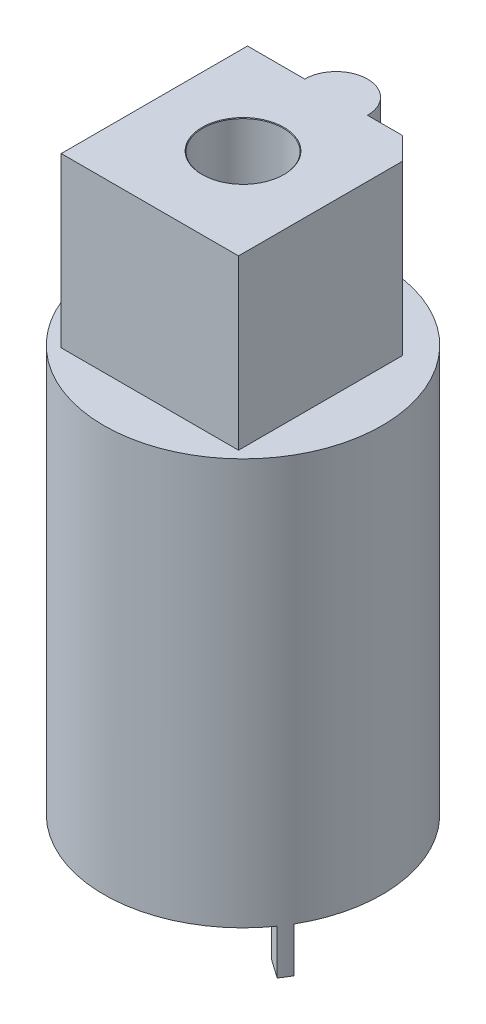
ISO-10303-21;
HEADER;
FILE_DESCRIPTION(('STEP AP214'),'2;1');
FILE_NAME('part.step','',(''),(''),'','','');
FILE_SCHEMA(('AUTOMOTIVE_DESIGN { 1 0 10303 214 1 1 1 1 }'));
ENDSEC;
DATA;
#1=APPLICATION_CONTEXT('core data for automotive mechanical design processes');
#2=APPLICATION_PROTOCOL_DEFINITION('international standard','automotive_design',2000,#1);
#3=PRODUCT_CONTEXT('',#1,'mechanical');
#4=PRODUCT('Part','Part','',(#3));
#5=PRODUCT_RELATED_PRODUCT_CATEGORY('part','',(#4));
#6=PRODUCT_DEFINITION_FORMATION('','',#4);
#7=PRODUCT_DEFINITION_CONTEXT('part definition',#1,'design');
#8=PRODUCT_DEFINITION('design','',#6,#7);
#9=PRODUCT_DEFINITION_SHAPE('','',#8);
#10=(LENGTH_UNIT() NAMED_UNIT(*) SI_UNIT(.MILLI.,.METRE.));
#11=(NAMED_UNIT(*) PLANE_ANGLE_UNIT() SI_UNIT($,.RADIAN.));
#12=(NAMED_UNIT(*) SI_UNIT($,.STERADIAN.) SOLID_ANGLE_UNIT());
#13=UNCERTAINTY_MEASURE_WITH_UNIT(LENGTH_MEASURE(1.E-05),#10,'distance_accuracy_value','');
#14=(GEOMETRIC_REPRESENTATION_CONTEXT(3) GLOBAL_UNCERTAINTY_ASSIGNED_CONTEXT((#13)) GLOBAL_UNIT_ASSIGNED_CONTEXT((#10,
#11,#12)) REPRESENTATION_CONTEXT('',''));
#15=CARTESIAN_POINT('',(0.,0.,0.));
#16=DIRECTION('',(0.,0.,1.));
#17=DIRECTION('',(1.,0.,0.));
#18=AXIS2_PLACEMENT_3D('',#15,#16,#17);
#19=CARTESIAN_POINT('',(0.,18.1,0.));
#20=DIRECTION('',(0.,-1.,0.));
#21=DIRECTION('',(0.,0.,-1.));
#22=AXIS2_PLACEMENT_3D('',#19,#20,#21);
#23=CYLINDRICAL_SURFACE('',#22,6.2);
#24=CARTESIAN_POINT('',(0.,18.1,0.));
#25=DIRECTION('',(0.,1.,0.));
#26=DIRECTION('',(0.,0.,1.));
#27=AXIS2_PLACEMENT_3D('',#24,#25,#26);
#28=CIRCLE('',#27,6.2);
#29=CARTESIAN_POINT('',(0.,18.1,6.2));
#30=VERTEX_POINT('',#29);
#31=EDGE_CURVE('E212',#30,#30,#28,.T.);
#32=ORIENTED_EDGE('',*,*,#31,.F.);
#33=EDGE_LOOP('',(#32));
#34=FACE_BOUND('',#33,.T.);
#35=CARTESIAN_POINT('',(0.,0.,0.));
#36=DIRECTION('',(0.,1.,0.));
#37=DIRECTION('',(0.,0.,1.));
#38=AXIS2_PLACEMENT_3D('',#35,#36,#37);
#39=CIRCLE('',#38,6.2);
#40=CARTESIAN_POINT('',(5.36935750346351,0.,3.10000000000003));
#41=VERTEX_POINT('',#40);
#42=CARTESIAN_POINT('',(5.07874267459175,0.,3.55617390537649));
#43=VERTEX_POINT('',#42);
#44=EDGE_CURVE('E206',#41,#43,#39,.T.);
#45=ORIENTED_EDGE('',*,*,#44,.T.);
#46=DIRECTION('',(0.,1.,0.));
#47=VECTOR('',#46,1.);
#48=CARTESIAN_POINT('',(5.07874267459175,-2.,3.55617390537649));
#49=LINE('',#48,#47);
#50=CARTESIAN_POINT('',(5.07874267459175,-2.,3.55617390537649));
#51=VERTEX_POINT('',#50);
#52=EDGE_CURVE('E204',#51,#43,#49,.T.);
#53=ORIENTED_EDGE('',*,*,#52,.F.);
#54=CARTESIAN_POINT('',(0.,-2.,0.));
#55=DIRECTION('',(0.,1.,0.));
#56=DIRECTION('',(0.,0.,1.));
#57=AXIS2_PLACEMENT_3D('',#54,#55,#56);
#58=CIRCLE('',#57,6.2);
#59=CARTESIAN_POINT('',(5.36935750346351,-2.,3.10000000000003));
#60=VERTEX_POINT('',#59);
#61=EDGE_CURVE('E183',#51,#60,#58,.T.);
#62=ORIENTED_EDGE('',*,*,#61,.T.);
#63=DIRECTION('',(0.,1.,0.));
#64=VECTOR('',#63,1.);
#65=CARTESIAN_POINT('',(5.36935750346351,-2.,3.10000000000003));
#66=LINE('',#65,#64);
#67=EDGE_CURVE('E196',#60,#41,#66,.T.);
#68=ORIENTED_EDGE('',*,*,#67,.T.);
#69=EDGE_LOOP('',(#45,#53,#62,#68));
#70=FACE_BOUND('',#69,.T.);
#71=ADVANCED_FACE('F39',(#34,#70),#23,.T.);
#72=CARTESIAN_POINT('',(0.,18.1,0.));
#73=DIRECTION('',(0.,1.,0.));
#74=DIRECTION('',(0.,0.,1.));
#75=AXIS2_PLACEMENT_3D('',#72,#73,#74);
#76=PLANE('',#75);
#77=DIRECTION('',(0.,0.,-1.));
#78=VECTOR('',#77,1.);
#79=CARTESIAN_POINT('',(3.95,18.1,-4.15));
#80=LINE('',#79,#78);
#81=CARTESIAN_POINT('',(3.95,18.1,4.15));
#82=VERTEX_POINT('',#81);
#83=CARTESIAN_POINT('',(3.95,18.1,-3.15));
#84=VERTEX_POINT('',#83);
#85=EDGE_CURVE('E132',#82,#84,#80,.T.);
#86=ORIENTED_EDGE('',*,*,#85,.F.);
#87=DIRECTION('',(1.,0.,0.));
#88=VECTOR('',#87,1.);
#89=CARTESIAN_POINT('',(-3.95,18.1,4.15));
#90=LINE('',#89,#88);
#91=CARTESIAN_POINT('',(-3.95,18.1,4.15));
#92=VERTEX_POINT('',#91);
#93=EDGE_CURVE('E145',#92,#82,#90,.T.);
#94=ORIENTED_EDGE('',*,*,#93,.F.);
#95=DIRECTION('',(0.,0.,1.));
#96=VECTOR('',#95,1.);
#97=CARTESIAN_POINT('',(-3.95,18.1,-4.15));
#98=LINE('',#97,#96);
#99=CARTESIAN_POINT('',(-3.95,18.1,-4.15));
#100=VERTEX_POINT('',#99);
#101=EDGE_CURVE('E163',#100,#92,#98,.T.);
#102=ORIENTED_EDGE('',*,*,#101,.F.);
#103=DIRECTION('',(-1.,0.,0.));
#104=VECTOR('',#103,1.);
#105=CARTESIAN_POINT('',(-3.95,18.1,-4.15));
#106=LINE('',#105,#104);
#107=CARTESIAN_POINT('',(-1.4,18.1,-4.15));
#108=VERTEX_POINT('',#107);
#109=EDGE_CURVE('E160',#108,#100,#106,.T.);
#110=ORIENTED_EDGE('',*,*,#109,.F.);
#111=CARTESIAN_POINT('',(0.,18.1,-4.15));
#112=DIRECTION('',(0.,1.,0.));
#113=DIRECTION('',(0.,0.,1.));
#114=AXIS2_PLACEMENT_3D('',#111,#112,#113);
#115=CIRCLE('',#114,1.4);
#116=CARTESIAN_POINT('',(1.4,18.1,-4.15));
#117=VERTEX_POINT('',#116);
#118=EDGE_CURVE('E157',#117,#108,#115,.T.);
#119=ORIENTED_EDGE('',*,*,#118,.F.);
#120=DIRECTION('',(-1.,0.,0.));
#121=VECTOR('',#120,1.);
#122=CARTESIAN_POINT('',(1.4,18.1,-4.15));
#123=LINE('',#122,#121);
#124=CARTESIAN_POINT('',(2.95,18.1,-4.15));
#125=VERTEX_POINT('',#124);
#126=EDGE_CURVE('E135',#125,#117,#123,.T.);
#127=ORIENTED_EDGE('',*,*,#126,.F.);
#128=DIRECTION('',(-0.707106781186546,0.,-0.707106781186549));
#129=VECTOR('',#128,1.);
#130=CARTESIAN_POINT('',(2.95,18.1,-4.15));
#131=LINE('',#130,#129);
#132=EDGE_CURVE('E11',#125,#84,#131,.F.);
#133=ORIENTED_EDGE('',*,*,#132,.T.);
#134=EDGE_LOOP('',(#86,#94,#102,#110,#119,#127,#133));
#135=FACE_BOUND('',#134,.T.);
#136=ORIENTED_EDGE('',*,*,#31,.T.);
#137=EDGE_LOOP('',(#136));
#138=FACE_BOUND('',#137,.T.);
#139=ADVANCED_FACE('F238',(#135,#138),#76,.T.);
#140=CARTESIAN_POINT('',(0.,0.,0.));
#141=DIRECTION('',(0.,1.,0.));
#142=DIRECTION('',(0.,0.,1.));
#143=AXIS2_PLACEMENT_3D('',#140,#141,#142);
#144=PLANE('',#143);
#145=ORIENTED_EDGE('',*,*,#44,.F.);
#146=DIRECTION('',(-0.866025403784436,0.,-0.500000000000004));
#147=VECTOR('',#146,1.);
#148=CARTESIAN_POINT('',(4.50333209967907,0.,2.60000000000002));
#149=LINE('',#148,#147);
#150=CARTESIAN_POINT('',(4.50333209967907,0.,2.60000000000002));
#151=VERTEX_POINT('',#150);
#152=EDGE_CURVE('E182',#41,#151,#149,.T.);
#153=ORIENTED_EDGE('',*,*,#152,.T.);
#154=CARTESIAN_POINT('',(0.,0.,0.));
#155=DIRECTION('',(0.,-1.,0.));
#156=DIRECTION('',(0.,0.,1.));
#157=AXIS2_PLACEMENT_3D('',#154,#155,#156);
#158=CIRCLE('',#157,5.2);
#159=CARTESIAN_POINT('',(4.25959063030276,0.,2.98259746902544));
#160=VERTEX_POINT('',#159);
#161=EDGE_CURVE('E199',#151,#160,#158,.T.);
#162=ORIENTED_EDGE('',*,*,#161,.T.);
#163=DIRECTION('',(0.819152044288992,0.,0.573576436351046));
#164=VECTOR('',#163,1.);
#165=CARTESIAN_POINT('',(4.25959063030276,0.,2.98259746902544));
#166=LINE('',#165,#164);
#167=EDGE_CURVE('E187',#160,#43,#166,.T.);
#168=ORIENTED_EDGE('',*,*,#167,.T.);
#169=EDGE_LOOP('',(#145,#153,#162,#168));
#170=FACE_BOUND('',#169,.T.);
#171=ADVANCED_FACE('F243',(#170),#144,.F.);
#172=CARTESIAN_POINT('',(4.25959063030276,-2.,2.98259746902544));
#173=DIRECTION('',(-0.573576436351046,0.,0.819152044288992));
#174=DIRECTION('',(0.819152044288992,0.,0.573576436351046));
#175=AXIS2_PLACEMENT_3D('',#172,#173,#174);
#176=PLANE('',#175);
#177=ORIENTED_EDGE('',*,*,#167,.F.);
#178=DIRECTION('',(0.,1.,0.));
#179=VECTOR('',#178,1.);
#180=CARTESIAN_POINT('',(4.25959063030276,-2.,2.98259746902544));
#181=LINE('',#180,#179);
#182=CARTESIAN_POINT('',(4.25959063030276,-2.,2.98259746902544));
#183=VERTEX_POINT('',#182);
#184=EDGE_CURVE('E207',#183,#160,#181,.T.);
#185=ORIENTED_EDGE('',*,*,#184,.F.);
#186=DIRECTION('',(0.819152044288992,0.,0.573576436351046));
#187=VECTOR('',#186,1.);
#188=CARTESIAN_POINT('',(4.25959063030276,-2.,2.98259746902544));
#189=LINE('',#188,#187);
#190=EDGE_CURVE('E193',#183,#51,#189,.T.);
#191=ORIENTED_EDGE('',*,*,#190,.T.);
#192=ORIENTED_EDGE('',*,*,#52,.T.);
#193=EDGE_LOOP('',(#177,#185,#191,#192));
#194=FACE_BOUND('',#193,.T.);
#195=ADVANCED_FACE('F249',(#194),#176,.T.);
#196=CARTESIAN_POINT('',(0.,-2.,0.));
#197=DIRECTION('',(0.,1.,0.));
#198=DIRECTION('',(0.,0.,1.));
#199=AXIS2_PLACEMENT_3D('',#196,#197,#198);
#200=CYLINDRICAL_SURFACE('',#199,5.2);
#201=ORIENTED_EDGE('',*,*,#161,.F.);
#202=DIRECTION('',(0.,1.,0.));
#203=VECTOR('',#202,1.);
#204=CARTESIAN_POINT('',(4.50333209967907,-2.,2.60000000000002));
#205=LINE('',#204,#203);
#206=CARTESIAN_POINT('',(4.50333209967907,-2.,2.60000000000002));
#207=VERTEX_POINT('',#206);
#208=EDGE_CURVE('E209',#207,#151,#205,.T.);
#209=ORIENTED_EDGE('',*,*,#208,.F.);
#210=CARTESIAN_POINT('',(0.,-2.,0.));
#211=DIRECTION('',(0.,-1.,0.));
#212=DIRECTION('',(0.,0.,1.));
#213=AXIS2_PLACEMENT_3D('',#210,#211,#212);
#214=CIRCLE('',#213,5.2);
#215=EDGE_CURVE('E190',#207,#183,#214,.T.);
#216=ORIENTED_EDGE('',*,*,#215,.T.);
#217=ORIENTED_EDGE('',*,*,#184,.T.);
#218=EDGE_LOOP('',(#201,#209,#216,#217));
#219=FACE_BOUND('',#218,.T.);
#220=ADVANCED_FACE('F256',(#219),#200,.F.);
#221=CARTESIAN_POINT('',(4.50333209967907,-2.,2.60000000000002));
#222=DIRECTION('',(0.500000000000004,0.,-0.866025403784436));
#223=DIRECTION('',(-0.866025403784436,0.,-0.500000000000004));
#224=AXIS2_PLACEMENT_3D('',#221,#222,#223);
#225=PLANE('',#224);
#226=ORIENTED_EDGE('',*,*,#152,.F.);
#227=ORIENTED_EDGE('',*,*,#67,.F.);
#228=DIRECTION('',(-0.866025403784436,0.,-0.500000000000004));
#229=VECTOR('',#228,1.);
#230=CARTESIAN_POINT('',(4.50333209967907,-2.,2.60000000000002));
#231=LINE('',#230,#229);
#232=EDGE_CURVE('E186',#60,#207,#231,.T.);
#233=ORIENTED_EDGE('',*,*,#232,.T.);
#234=ORIENTED_EDGE('',*,*,#208,.T.);
#235=EDGE_LOOP('',(#226,#227,#233,#234));
#236=FACE_BOUND('',#235,.T.);
#237=ADVANCED_FACE('F252',(#236),#225,.T.);
#238=CARTESIAN_POINT('',(0.,-2.,0.));
#239=DIRECTION('',(0.,1.,0.));
#240=DIRECTION('',(0.,0.,1.));
#241=AXIS2_PLACEMENT_3D('',#238,#239,#240);
#242=PLANE('',#241);
#243=ORIENTED_EDGE('',*,*,#61,.F.);
#244=ORIENTED_EDGE('',*,*,#190,.F.);
#245=ORIENTED_EDGE('',*,*,#215,.F.);
#246=ORIENTED_EDGE('',*,*,#232,.F.);
#247=EDGE_LOOP('',(#243,#244,#245,#246));
#248=FACE_BOUND('',#247,.T.);
#249=ADVANCED_FACE('F255',(#248),#242,.F.);
#250=CARTESIAN_POINT('',(3.95,25.6,-4.15));
#251=DIRECTION('',(-1.,0.,0.));
#252=DIRECTION('',(0.,0.,1.));
#253=AXIS2_PLACEMENT_3D('',#250,#251,#252);
#254=PLANE('',#253);
#255=ORIENTED_EDGE('',*,*,#85,.T.);
#256=DIRECTION('',(0.,1.,0.));
#257=VECTOR('',#256,1.);
#258=CARTESIAN_POINT('',(3.95,25.6,-3.15));
#259=LINE('',#258,#257);
#260=CARTESIAN_POINT('',(3.95,25.6,-3.15));
#261=VERTEX_POINT('',#260);
#262=EDGE_CURVE('E55',#84,#261,#259,.T.);
#263=ORIENTED_EDGE('',*,*,#262,.T.);
#264=DIRECTION('',(0.,0.,-1.));
#265=VECTOR('',#264,1.);
#266=CARTESIAN_POINT('',(3.95,25.6,-4.15));
#267=LINE('',#266,#265);
#268=CARTESIAN_POINT('',(3.95,25.6,4.15));
#269=VERTEX_POINT('',#268);
#270=EDGE_CURVE('E142',#269,#261,#267,.T.);
#271=ORIENTED_EDGE('',*,*,#270,.F.);
#272=DIRECTION('',(0.,-1.,0.));
#273=VECTOR('',#272,1.);
#274=CARTESIAN_POINT('',(3.95,25.6,4.15));
#275=LINE('',#274,#273);
#276=EDGE_CURVE('E154',#269,#82,#275,.T.);
#277=ORIENTED_EDGE('',*,*,#276,.T.);
#278=EDGE_LOOP('',(#255,#263,#271,#277));
#279=FACE_BOUND('',#278,.T.);
#280=ADVANCED_FACE('F266',(#279),#254,.F.);
#281=CARTESIAN_POINT('',(1.4,25.6,-4.15));
#282=DIRECTION('',(0.,0.,1.));
#283=DIRECTION('',(1.,0.,0.));
#284=AXIS2_PLACEMENT_3D('',#281,#282,#283);
#285=PLANE('',#284);
#286=DIRECTION('',(-1.,0.,0.));
#287=VECTOR('',#286,1.);
#288=CARTESIAN_POINT('',(1.4,25.6,-4.15));
#289=LINE('',#288,#287);
#290=CARTESIAN_POINT('',(2.95,25.6,-4.15));
#291=VERTEX_POINT('',#290);
#292=CARTESIAN_POINT('',(1.4,25.6,-4.15));
#293=VERTEX_POINT('',#292);
#294=EDGE_CURVE('E144',#291,#293,#289,.T.);
#295=ORIENTED_EDGE('',*,*,#294,.F.);
#296=DIRECTION('',(0.,-1.,0.));
#297=VECTOR('',#296,1.);
#298=CARTESIAN_POINT('',(2.95,25.6,-4.15));
#299=LINE('',#298,#297);
#300=EDGE_CURVE('E215',#291,#125,#299,.T.);
#301=ORIENTED_EDGE('',*,*,#300,.T.);
#302=ORIENTED_EDGE('',*,*,#126,.T.);
#303=DIRECTION('',(0.,-1.,0.));
#304=VECTOR('',#303,1.);
#305=CARTESIAN_POINT('',(1.4,25.6,-4.15));
#306=LINE('',#305,#304);
#307=EDGE_CURVE('E179',#293,#117,#306,.T.);
#308=ORIENTED_EDGE('',*,*,#307,.F.);
#309=EDGE_LOOP('',(#295,#301,#302,#308));
#310=FACE_BOUND('',#309,.T.);
#311=ADVANCED_FACE('F228',(#310),#285,.F.);
#312=CARTESIAN_POINT('',(0.,25.6,-4.15));
#313=DIRECTION('',(0.,-1.,0.));
#314=DIRECTION('',(0.,0.,-1.));
#315=AXIS2_PLACEMENT_3D('',#312,#313,#314);
#316=CYLINDRICAL_SURFACE('',#315,1.4);
#317=ORIENTED_EDGE('',*,*,#118,.T.);
#318=DIRECTION('',(0.,-1.,0.));
#319=VECTOR('',#318,1.);
#320=CARTESIAN_POINT('',(-1.4,25.6,-4.15));
#321=LINE('',#320,#319);
#322=CARTESIAN_POINT('',(-1.4,25.6,-4.15));
#323=VERTEX_POINT('',#322);
#324=EDGE_CURVE('E176',#323,#108,#321,.T.);
#325=ORIENTED_EDGE('',*,*,#324,.F.);
#326=CARTESIAN_POINT('',(0.,25.6,-4.15));
#327=DIRECTION('',(0.,1.,0.));
#328=DIRECTION('',(0.,0.,1.));
#329=AXIS2_PLACEMENT_3D('',#326,#327,#328);
#330=CIRCLE('',#329,1.4);
#331=EDGE_CURVE('E147',#293,#323,#330,.T.);
#332=ORIENTED_EDGE('',*,*,#331,.F.);
#333=ORIENTED_EDGE('',*,*,#307,.T.);
#334=EDGE_LOOP('',(#317,#325,#332,#333));
#335=FACE_BOUND('',#334,.T.);
#336=ADVANCED_FACE('F272',(#335),#316,.T.);
#337=CARTESIAN_POINT('',(-3.95,25.6,-4.15));
#338=DIRECTION('',(0.,0.,1.));
#339=DIRECTION('',(1.,0.,0.));
#340=AXIS2_PLACEMENT_3D('',#337,#338,#339);
#341=PLANE('',#340);
#342=ORIENTED_EDGE('',*,*,#109,.T.);
#343=DIRECTION('',(0.,-1.,0.));
#344=VECTOR('',#343,1.);
#345=CARTESIAN_POINT('',(-3.95,25.6,-4.15));
#346=LINE('',#345,#344);
#347=CARTESIAN_POINT('',(-3.95,25.6,-4.15));
#348=VERTEX_POINT('',#347);
#349=EDGE_CURVE('E173',#348,#100,#346,.T.);
#350=ORIENTED_EDGE('',*,*,#349,.F.);
#351=DIRECTION('',(-1.,0.,0.));
#352=VECTOR('',#351,1.);
#353=CARTESIAN_POINT('',(-3.95,25.6,-4.15));
#354=LINE('',#353,#352);
#355=EDGE_CURVE('E149',#323,#348,#354,.T.);
#356=ORIENTED_EDGE('',*,*,#355,.F.);
#357=ORIENTED_EDGE('',*,*,#324,.T.);
#358=EDGE_LOOP('',(#342,#350,#356,#357));
#359=FACE_BOUND('',#358,.T.);
#360=ADVANCED_FACE('F275',(#359),#341,.F.);
#361=CARTESIAN_POINT('',(-3.95,25.6,-4.15));
#362=DIRECTION('',(1.,0.,0.));
#363=DIRECTION('',(0.,0.,-1.));
#364=AXIS2_PLACEMENT_3D('',#361,#362,#363);
#365=PLANE('',#364);
#366=ORIENTED_EDGE('',*,*,#101,.T.);
#367=DIRECTION('',(0.,-1.,0.));
#368=VECTOR('',#367,1.);
#369=CARTESIAN_POINT('',(-3.95,25.6,4.15));
#370=LINE('',#369,#368);
#371=CARTESIAN_POINT('',(-3.95,25.6,4.15));
#372=VERTEX_POINT('',#371);
#373=EDGE_CURVE('E170',#372,#92,#370,.T.);
#374=ORIENTED_EDGE('',*,*,#373,.F.);
#375=DIRECTION('',(0.,0.,1.));
#376=VECTOR('',#375,1.);
#377=CARTESIAN_POINT('',(-3.95,25.6,-4.15));
#378=LINE('',#377,#376);
#379=EDGE_CURVE('E151',#348,#372,#378,.T.);
#380=ORIENTED_EDGE('',*,*,#379,.F.);
#381=ORIENTED_EDGE('',*,*,#349,.T.);
#382=EDGE_LOOP('',(#366,#374,#380,#381));
#383=FACE_BOUND('',#382,.T.);
#384=ADVANCED_FACE('F279',(#383),#365,.F.);
#385=CARTESIAN_POINT('',(-3.95,25.6,4.15));
#386=DIRECTION('',(0.,0.,-1.));
#387=DIRECTION('',(-1.,0.,0.));
#388=AXIS2_PLACEMENT_3D('',#385,#386,#387);
#389=PLANE('',#388);
#390=ORIENTED_EDGE('',*,*,#93,.T.);
#391=ORIENTED_EDGE('',*,*,#276,.F.);
#392=DIRECTION('',(1.,0.,0.));
#393=VECTOR('',#392,1.);
#394=CARTESIAN_POINT('',(-3.95,25.6,4.15));
#395=LINE('',#394,#393);
#396=EDGE_CURVE('E153',#372,#269,#395,.T.);
#397=ORIENTED_EDGE('',*,*,#396,.F.);
#398=ORIENTED_EDGE('',*,*,#373,.T.);
#399=EDGE_LOOP('',(#390,#391,#397,#398));
#400=FACE_BOUND('',#399,.T.);
#401=ADVANCED_FACE('F234',(#400),#389,.F.);
#402=CARTESIAN_POINT('',(0.,25.6,-4.15));
#403=DIRECTION('',(0.,1.,0.));
#404=DIRECTION('',(0.,0.,1.));
#405=AXIS2_PLACEMENT_3D('',#402,#403,#404);
#406=PLANE('',#405);
#407=CARTESIAN_POINT('',(0.,25.6,0.));
#408=DIRECTION('',(0.,1.,0.));
#409=DIRECTION('',(0.,0.,1.));
#410=AXIS2_PLACEMENT_3D('',#407,#408,#409);
#411=CIRCLE('',#410,1.825);
#412=CARTESIAN_POINT('',(0.,25.6,1.825));
#413=VERTEX_POINT('',#412);
#414=EDGE_CURVE('E138',#413,#413,#411,.T.);
#415=ORIENTED_EDGE('',*,*,#414,.F.);
#416=EDGE_LOOP('',(#415));
#417=FACE_BOUND('',#416,.T.);
#418=ORIENTED_EDGE('',*,*,#270,.T.);
#419=DIRECTION('',(0.707106781186546,0.,0.707106781186549));
#420=VECTOR('',#419,1.);
#421=CARTESIAN_POINT('',(1.47500000000001,25.6,-5.625));
#422=LINE('',#421,#420);
#423=EDGE_CURVE('E48',#261,#291,#422,.F.);
#424=ORIENTED_EDGE('',*,*,#423,.T.);
#425=ORIENTED_EDGE('',*,*,#294,.T.);
#426=ORIENTED_EDGE('',*,*,#331,.T.);
#427=ORIENTED_EDGE('',*,*,#355,.T.);
#428=ORIENTED_EDGE('',*,*,#379,.T.);
#429=ORIENTED_EDGE('',*,*,#396,.T.);
#430=EDGE_LOOP('',(#418,#424,#425,#426,#427,#428,#429));
#431=FACE_BOUND('',#430,.T.);
#432=ADVANCED_FACE('F223',(#417,#431),#406,.T.);
#433=CARTESIAN_POINT('',(2.95,25.6,-4.15));
#434=DIRECTION('',(-0.707106781186549,0.,0.707106781186546));
#435=DIRECTION('',(0.,-1.,0.));
#436=AXIS2_PLACEMENT_3D('',#433,#434,#435);
#437=PLANE('',#436);
#438=ORIENTED_EDGE('',*,*,#423,.F.);
#439=ORIENTED_EDGE('',*,*,#262,.F.);
#440=ORIENTED_EDGE('',*,*,#132,.F.);
#441=ORIENTED_EDGE('',*,*,#300,.F.);
#442=EDGE_LOOP('',(#438,#439,#440,#441));
#443=FACE_BOUND('',#442,.T.);
#444=ADVANCED_FACE('F42',(#443),#437,.F.);
#445=CARTESIAN_POINT('',(0.,15.6,0.));
#446=DIRECTION('',(0.,1.,0.));
#447=DIRECTION('',(0.,0.,1.));
#448=AXIS2_PLACEMENT_3D('',#445,#446,#447);
#449=CONICAL_SURFACE('',#448,1.8,1.02974425867665);
#450=CARTESIAN_POINT('',(0.,14.5184508857504,0.));
#451=VERTEX_POINT('',#450);
#452=VERTEX_LOOP('',#451);
#453=FACE_BOUND('',#452,.T.);
#454=CARTESIAN_POINT('',(0.,15.6,0.));
#455=DIRECTION('',(0.,1.,0.));
#456=DIRECTION('',(0.,0.,1.));
#457=AXIS2_PLACEMENT_3D('',#454,#455,#456);
#458=CIRCLE('',#457,1.8);
#459=CARTESIAN_POINT('',(0.,15.6,1.8));
#460=VERTEX_POINT('',#459);
#461=EDGE_CURVE('E130',#460,#460,#458,.T.);
#462=ORIENTED_EDGE('',*,*,#461,.T.);
#463=EDGE_LOOP('',(#462));
#464=FACE_BOUND('',#463,.T.);
#465=ADVANCED_FACE('F123',(#453,#464),#449,.F.);
#466=CARTESIAN_POINT('',(0.,25.6,0.));
#467=DIRECTION('',(0.,1.,0.));
#468=DIRECTION('',(0.,0.,1.));
#469=AXIS2_PLACEMENT_3D('',#466,#467,#468);
#470=CYLINDRICAL_SURFACE('',#469,1.8);
#471=ORIENTED_EDGE('',*,*,#461,.F.);
#472=EDGE_LOOP('',(#471));
#473=FACE_BOUND('',#472,.T.);
#474=CARTESIAN_POINT('',(0.,25.575,0.));
#475=DIRECTION('',(0.,1.,0.));
#476=DIRECTION('',(0.,0.,1.));
#477=AXIS2_PLACEMENT_3D('',#474,#475,#476);
#478=CIRCLE('',#477,1.8);
#479=CARTESIAN_POINT('',(0.,25.575,1.8));
#480=VERTEX_POINT('',#479);
#481=EDGE_CURVE('E133',#480,#480,#478,.T.);
#482=ORIENTED_EDGE('',*,*,#481,.T.);
#483=EDGE_LOOP('',(#482));
#484=FACE_BOUND('',#483,.T.);
#485=ADVANCED_FACE('F126',(#473,#484),#470,.F.);
#486=CARTESIAN_POINT('',(0.,25.6,0.));
#487=DIRECTION('',(0.,1.,0.));
#488=DIRECTION('',(0.,0.,1.));
#489=AXIS2_PLACEMENT_3D('',#486,#487,#488);
#490=CONICAL_SURFACE('',#489,1.825,0.785398163397414);
#491=ORIENTED_EDGE('',*,*,#481,.F.);
#492=EDGE_LOOP('',(#491));
#493=FACE_BOUND('',#492,.T.);
#494=ORIENTED_EDGE('',*,*,#414,.T.);
#495=EDGE_LOOP('',(#494));
#496=FACE_BOUND('',#495,.T.);
#497=ADVANCED_FACE('F289',(#493,#496),#490,.F.);
#498=CLOSED_SHELL('',(#71,#139,#171,#195,#220,#237,#249,#280,#311,#336,#360,#384,#401,#432,#444,
#465,#485,#497));
#499=MANIFOLD_SOLID_BREP('B2',#498);
#500=ADVANCED_BREP_SHAPE_REPRESENTATION('',(#18,#499),#14);
#501=SHAPE_DEFINITION_REPRESENTATION(#9,#500);
ENDSEC;
END-ISO-10303-21;
